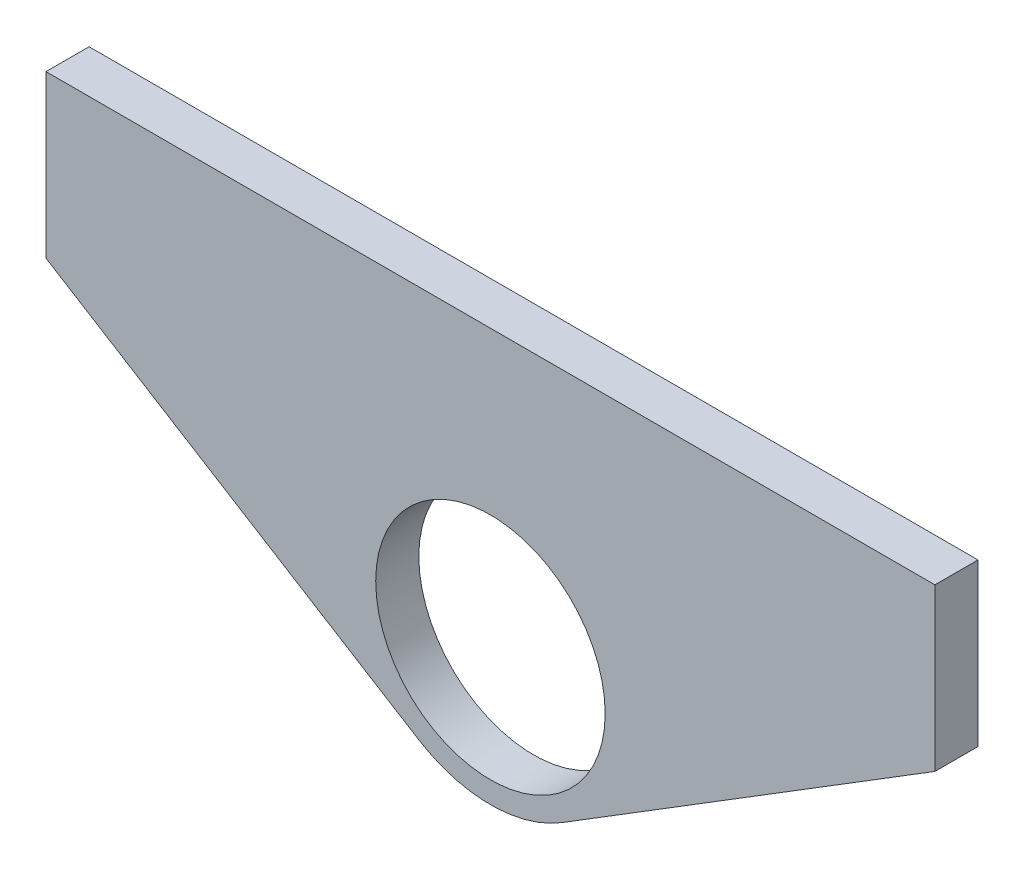
ISO-10303-21;
HEADER;
FILE_DESCRIPTION(('STEP AP214'),'2;1');
FILE_NAME('part.step','',(''),(''),'','','');
FILE_SCHEMA(('AUTOMOTIVE_DESIGN { 1 0 10303 214 1 1 1 1 }'));
ENDSEC;
DATA;
#1=APPLICATION_CONTEXT('core data for automotive mechanical design processes');
#2=APPLICATION_PROTOCOL_DEFINITION('international standard','automotive_design',2000,#1);
#3=PRODUCT_CONTEXT('',#1,'mechanical');
#4=PRODUCT('Part','Part','',(#3));
#5=PRODUCT_RELATED_PRODUCT_CATEGORY('part','',(#4));
#6=PRODUCT_DEFINITION_FORMATION('','',#4);
#7=PRODUCT_DEFINITION_CONTEXT('part definition',#1,'design');
#8=PRODUCT_DEFINITION('design','',#6,#7);
#9=PRODUCT_DEFINITION_SHAPE('','',#8);
#10=(LENGTH_UNIT() NAMED_UNIT(*) SI_UNIT(.MILLI.,.METRE.));
#11=(NAMED_UNIT(*) PLANE_ANGLE_UNIT() SI_UNIT($,.RADIAN.));
#12=(NAMED_UNIT(*) SI_UNIT($,.STERADIAN.) SOLID_ANGLE_UNIT());
#13=UNCERTAINTY_MEASURE_WITH_UNIT(LENGTH_MEASURE(1.E-05),#10,'distance_accuracy_value','');
#14=(GEOMETRIC_REPRESENTATION_CONTEXT(3) GLOBAL_UNCERTAINTY_ASSIGNED_CONTEXT((#13)) GLOBAL_UNIT_ASSIGNED_CONTEXT((#10,
#11,#12)) REPRESENTATION_CONTEXT('',''));
#15=CARTESIAN_POINT('',(0.,0.,0.));
#16=DIRECTION('',(0.,0.,1.));
#17=DIRECTION('',(1.,0.,0.));
#18=AXIS2_PLACEMENT_3D('',#15,#16,#17);
#19=CARTESIAN_POINT('',(0.,15.,-4.));
#20=DIRECTION('',(0.999999999999999,0.,0.));
#21=DIRECTION('',(0.,0.999999999999999,0.));
#22=AXIS2_PLACEMENT_3D('',#19,#20,#21);
#23=PLANE('',#22);
#24=DIRECTION('',(0.,0.999999999999999,0.));
#25=VECTOR('',#24,1.);
#26=CARTESIAN_POINT('',(0.,15.,0.));
#27=LINE('',#26,#25);
#28=CARTESIAN_POINT('',(0.,0.,0.));
#29=VERTEX_POINT('',#28);
#30=CARTESIAN_POINT('',(0.,15.,0.));
#31=VERTEX_POINT('',#30);
#32=EDGE_CURVE('E119',#29,#31,#27,.T.);
#33=ORIENTED_EDGE('',*,*,#32,.F.);
#34=DIRECTION('',(0.,0.,0.999999999999999));
#35=VECTOR('',#34,1.);
#36=CARTESIAN_POINT('',(0.,0.,-4.));
#37=LINE('',#36,#35);
#38=CARTESIAN_POINT('',(0.,0.,-4.));
#39=VERTEX_POINT('',#38);
#40=EDGE_CURVE('E11',#39,#29,#37,.T.);
#41=ORIENTED_EDGE('',*,*,#40,.F.);
#42=DIRECTION('',(0.,0.999999999999999,0.));
#43=VECTOR('',#42,1.);
#44=CARTESIAN_POINT('',(0.,15.,-4.));
#45=LINE('',#44,#43);
#46=CARTESIAN_POINT('',(0.,15.,-4.));
#47=VERTEX_POINT('',#46);
#48=EDGE_CURVE('E134',#39,#47,#45,.T.);
#49=ORIENTED_EDGE('',*,*,#48,.T.);
#50=DIRECTION('',(0.,0.,0.999999999999999));
#51=VECTOR('',#50,1.);
#52=CARTESIAN_POINT('',(0.,15.,-4.));
#53=LINE('',#52,#51);
#54=EDGE_CURVE('E37',#47,#31,#53,.T.);
#55=ORIENTED_EDGE('',*,*,#54,.T.);
#56=EDGE_LOOP('',(#33,#41,#49,#55));
#57=FACE_BOUND('',#56,.T.);
#58=ADVANCED_FACE('F34',(#57),#23,.T.);
#59=CARTESIAN_POINT('',(0.,0.,-4.));
#60=DIRECTION('',(0.5262032264563,-0.850358844527989,0.));
#61=DIRECTION('',(0.85035884452799,0.526203226456302,0.));
#62=AXIS2_PLACEMENT_3D('',#59,#60,#61);
#63=PLANE('',#62);
#64=DIRECTION('',(0.85035884452799,0.526203226456302,0.));
#65=VECTOR('',#64,1.);
#66=CARTESIAN_POINT('',(0.,0.,0.));
#67=LINE('',#66,#65);
#68=CARTESIAN_POINT('',(-34.5943627091045,-21.4070393832791,-1.66533453693773E-13));
#69=VERTEX_POINT('',#68);
#70=EDGE_CURVE('E132',#69,#29,#67,.T.);
#71=ORIENTED_EDGE('',*,*,#70,.F.);
#72=DIRECTION('',(0.,0.,0.999999999999999));
#73=VECTOR('',#72,1.);
#74=CARTESIAN_POINT('',(-34.5943627091045,-21.4070393832791,-4.00000000000017));
#75=LINE('',#74,#73);
#76=CARTESIAN_POINT('',(-34.5943627091045,-21.4070393832791,-4.00000000000017));
#77=VERTEX_POINT('',#76);
#78=EDGE_CURVE('E43',#77,#69,#75,.T.);
#79=ORIENTED_EDGE('',*,*,#78,.F.);
#80=DIRECTION('',(0.85035884452799,0.526203226456302,0.));
#81=VECTOR('',#80,1.);
#82=CARTESIAN_POINT('',(0.,0.,-4.));
#83=LINE('',#82,#81);
#84=EDGE_CURVE('E109',#77,#39,#83,.T.);
#85=ORIENTED_EDGE('',*,*,#84,.T.);
#86=ORIENTED_EDGE('',*,*,#40,.T.);
#87=EDGE_LOOP('',(#71,#79,#85,#86));
#88=FACE_BOUND('',#87,.T.);
#89=ADVANCED_FACE('F142',(#88),#63,.T.);
#90=CARTESIAN_POINT('',(-41.2508335237767,-10.6500000000001,-4.00000000000011));
#91=DIRECTION('',(0.,0.,0.999999999999999));
#92=DIRECTION('',(0.999999999999999,0.,0.));
#93=AXIS2_PLACEMENT_3D('',#90,#91,#92);
#94=CYLINDRICAL_SURFACE('',#93,12.65);
#95=CARTESIAN_POINT('',(-41.2508335237767,-10.6500000000001,-1.66533453693773E-13));
#96=DIRECTION('',(0.,0.,0.999999999999999));
#97=DIRECTION('',(0.999999999999999,0.,0.));
#98=AXIS2_PLACEMENT_3D('',#95,#96,#97);
#99=CIRCLE('',#98,12.65);
#100=CARTESIAN_POINT('',(-47.907304338449,-21.4070393832791,0.));
#101=VERTEX_POINT('',#100);
#102=EDGE_CURVE('E96',#101,#69,#99,.T.);
#103=ORIENTED_EDGE('',*,*,#102,.F.);
#104=DIRECTION('',(0.,0.,0.999999999999999));
#105=VECTOR('',#104,1.);
#106=CARTESIAN_POINT('',(-47.907304338449,-21.4070393832791,-4.));
#107=LINE('',#106,#105);
#108=CARTESIAN_POINT('',(-47.907304338449,-21.4070393832791,-4.));
#109=VERTEX_POINT('',#108);
#110=EDGE_CURVE('E91',#109,#101,#107,.T.);
#111=ORIENTED_EDGE('',*,*,#110,.F.);
#112=CARTESIAN_POINT('',(-41.2508335237767,-10.6500000000001,-4.00000000000011));
#113=DIRECTION('',(0.,0.,0.999999999999999));
#114=DIRECTION('',(0.999999999999999,0.,0.));
#115=AXIS2_PLACEMENT_3D('',#112,#113,#114);
#116=CIRCLE('',#115,12.65);
#117=EDGE_CURVE('E94',#109,#77,#116,.T.);
#118=ORIENTED_EDGE('',*,*,#117,.T.);
#119=ORIENTED_EDGE('',*,*,#78,.T.);
#120=EDGE_LOOP('',(#103,#111,#118,#119));
#121=FACE_BOUND('',#120,.T.);
#122=ADVANCED_FACE('F93',(#121),#94,.T.);
#123=CARTESIAN_POINT('',(-82.5016670475535,0.,-4.));
#124=DIRECTION('',(-0.526203226456302,-0.85035884452799,0.));
#125=DIRECTION('',(0.850358844527989,-0.5262032264563,0.));
#126=AXIS2_PLACEMENT_3D('',#123,#124,#125);
#127=PLANE('',#126);
#128=DIRECTION('',(0.850358844527989,-0.5262032264563,0.));
#129=VECTOR('',#128,1.);
#130=CARTESIAN_POINT('',(-82.5016670475535,0.,0.));
#131=LINE('',#130,#129);
#132=CARTESIAN_POINT('',(-82.5016670475535,0.,0.));
#133=VERTEX_POINT('',#132);
#134=EDGE_CURVE('E129',#133,#101,#131,.T.);
#135=ORIENTED_EDGE('',*,*,#134,.F.);
#136=DIRECTION('',(0.,0.,0.999999999999999));
#137=VECTOR('',#136,1.);
#138=CARTESIAN_POINT('',(-82.5016670475535,0.,-4.));
#139=LINE('',#138,#137);
#140=CARTESIAN_POINT('',(-82.5016670475535,0.,-4.));
#141=VERTEX_POINT('',#140);
#142=EDGE_CURVE('E101',#141,#133,#139,.T.);
#143=ORIENTED_EDGE('',*,*,#142,.F.);
#144=DIRECTION('',(0.850358844527989,-0.5262032264563,0.));
#145=VECTOR('',#144,1.);
#146=CARTESIAN_POINT('',(-82.5016670475535,0.,-4.));
#147=LINE('',#146,#145);
#148=EDGE_CURVE('E107',#141,#109,#147,.T.);
#149=ORIENTED_EDGE('',*,*,#148,.T.);
#150=ORIENTED_EDGE('',*,*,#110,.T.);
#151=EDGE_LOOP('',(#135,#143,#149,#150));
#152=FACE_BOUND('',#151,.T.);
#153=ADVANCED_FACE('F111',(#152),#127,.T.);
#154=CARTESIAN_POINT('',(-82.5016670475535,0.,-4.));
#155=DIRECTION('',(-0.999999999999999,0.,0.));
#156=DIRECTION('',(0.,-0.999999999999999,0.));
#157=AXIS2_PLACEMENT_3D('',#154,#155,#156);
#158=PLANE('',#157);
#159=DIRECTION('',(0.,-0.999999999999999,0.));
#160=VECTOR('',#159,1.);
#161=CARTESIAN_POINT('',(-82.5016670475535,0.,0.));
#162=LINE('',#161,#160);
#163=CARTESIAN_POINT('',(-82.5016670475535,14.9999999999999,0.));
#164=VERTEX_POINT('',#163);
#165=EDGE_CURVE('E126',#164,#133,#162,.T.);
#166=ORIENTED_EDGE('',*,*,#165,.F.);
#167=DIRECTION('',(0.,0.,0.999999999999999));
#168=VECTOR('',#167,1.);
#169=CARTESIAN_POINT('',(-82.5016670475535,14.9999999999999,-4.));
#170=LINE('',#169,#168);
#171=CARTESIAN_POINT('',(-82.5016670475535,14.9999999999999,-4.));
#172=VERTEX_POINT('',#171);
#173=EDGE_CURVE('E137',#172,#164,#170,.T.);
#174=ORIENTED_EDGE('',*,*,#173,.F.);
#175=DIRECTION('',(0.,-0.999999999999999,0.));
#176=VECTOR('',#175,1.);
#177=CARTESIAN_POINT('',(-82.5016670475535,0.,-4.));
#178=LINE('',#177,#176);
#179=EDGE_CURVE('E112',#172,#141,#178,.T.);
#180=ORIENTED_EDGE('',*,*,#179,.T.);
#181=ORIENTED_EDGE('',*,*,#142,.T.);
#182=EDGE_LOOP('',(#166,#174,#180,#181));
#183=FACE_BOUND('',#182,.T.);
#184=ADVANCED_FACE('F155',(#183),#158,.T.);
#185=CARTESIAN_POINT('',(-82.5016670475535,14.9999999999999,-4.));
#186=DIRECTION('',(0.,0.999999999999999,0.));
#187=DIRECTION('',(0.,0.,0.999999999999999));
#188=AXIS2_PLACEMENT_3D('',#185,#186,#187);
#189=PLANE('',#188);
#190=DIRECTION('',(-0.999999999999999,0.,0.));
#191=VECTOR('',#190,1.);
#192=CARTESIAN_POINT('',(-82.5016670475535,14.9999999999999,0.));
#193=LINE('',#192,#191);
#194=EDGE_CURVE('E122',#31,#164,#193,.T.);
#195=ORIENTED_EDGE('',*,*,#194,.F.);
#196=ORIENTED_EDGE('',*,*,#54,.F.);
#197=DIRECTION('',(-0.999999999999999,0.,0.));
#198=VECTOR('',#197,1.);
#199=CARTESIAN_POINT('',(-82.5016670475535,14.9999999999999,-4.));
#200=LINE('',#199,#198);
#201=EDGE_CURVE('E114',#47,#172,#200,.T.);
#202=ORIENTED_EDGE('',*,*,#201,.T.);
#203=ORIENTED_EDGE('',*,*,#173,.T.);
#204=EDGE_LOOP('',(#195,#196,#202,#203));
#205=FACE_BOUND('',#204,.T.);
#206=ADVANCED_FACE('F139',(#205),#189,.T.);
#207=CARTESIAN_POINT('',(-41.2508335237767,-10.6500000000001,-4.00000000000011));
#208=DIRECTION('',(0.,0.,0.999999999999999));
#209=DIRECTION('',(0.999999999999999,0.,0.));
#210=AXIS2_PLACEMENT_3D('',#207,#208,#209);
#211=PLANE('',#210);
#212=CARTESIAN_POINT('',(-41.2508335237768,-10.6500000000001,-4.00000000000011));
#213=DIRECTION('',(0.,0.,0.999999999999999));
#214=DIRECTION('',(0.999999999999999,0.,0.));
#215=AXIS2_PLACEMENT_3D('',#212,#213,#214);
#216=CIRCLE('',#215,10.65);
#217=CARTESIAN_POINT('',(-30.6008335237768,-10.6500000000001,-4.00000000000011));
#218=VERTEX_POINT('',#217);
#219=EDGE_CURVE('E123',#218,#218,#216,.T.);
#220=ORIENTED_EDGE('',*,*,#219,.T.);
#221=EDGE_LOOP('',(#220));
#222=FACE_BOUND('',#221,.T.);
#223=ORIENTED_EDGE('',*,*,#48,.F.);
#224=ORIENTED_EDGE('',*,*,#84,.F.);
#225=ORIENTED_EDGE('',*,*,#117,.F.);
#226=ORIENTED_EDGE('',*,*,#148,.F.);
#227=ORIENTED_EDGE('',*,*,#179,.F.);
#228=ORIENTED_EDGE('',*,*,#201,.F.);
#229=EDGE_LOOP('',(#223,#224,#225,#226,#227,#228));
#230=FACE_BOUND('',#229,.T.);
#231=ADVANCED_FACE('F105',(#222,#230),#211,.F.);
#232=CARTESIAN_POINT('',(-41.2508335237767,-10.6500000000001,-1.66533453693773E-13));
#233=DIRECTION('',(0.,0.,0.999999999999999));
#234=DIRECTION('',(0.999999999999999,0.,0.));
#235=AXIS2_PLACEMENT_3D('',#232,#233,#234);
#236=PLANE('',#235);
#237=CARTESIAN_POINT('',(-41.2508335237768,-10.6500000000001,-1.66533453693773E-13));
#238=DIRECTION('',(0.,0.,0.999999999999999));
#239=DIRECTION('',(0.999999999999999,0.,0.));
#240=AXIS2_PLACEMENT_3D('',#237,#238,#239);
#241=CIRCLE('',#240,10.65);
#242=CARTESIAN_POINT('',(-30.6008335237768,-10.65,-1.66533453693773E-13));
#243=VERTEX_POINT('',#242);
#244=EDGE_CURVE('E178',#243,#243,#241,.T.);
#245=ORIENTED_EDGE('',*,*,#244,.F.);
#246=EDGE_LOOP('',(#245));
#247=FACE_BOUND('',#246,.T.);
#248=ORIENTED_EDGE('',*,*,#32,.T.);
#249=ORIENTED_EDGE('',*,*,#194,.T.);
#250=ORIENTED_EDGE('',*,*,#165,.T.);
#251=ORIENTED_EDGE('',*,*,#134,.T.);
#252=ORIENTED_EDGE('',*,*,#102,.T.);
#253=ORIENTED_EDGE('',*,*,#70,.T.);
#254=EDGE_LOOP('',(#248,#249,#250,#251,#252,#253));
#255=FACE_BOUND('',#254,.T.);
#256=ADVANCED_FACE('F141',(#247,#255),#236,.T.);
#257=CARTESIAN_POINT('',(-41.2508335237768,-10.6500000000001,-4.00000000000011));
#258=DIRECTION('',(0.,0.,0.999999999999999));
#259=DIRECTION('',(0.999999999999999,0.,0.));
#260=AXIS2_PLACEMENT_3D('',#257,#258,#259);
#261=CYLINDRICAL_SURFACE('',#260,10.65);
#262=ORIENTED_EDGE('',*,*,#219,.F.);
#263=EDGE_LOOP('',(#262));
#264=FACE_BOUND('',#263,.T.);
#265=ORIENTED_EDGE('',*,*,#244,.T.);
#266=EDGE_LOOP('',(#265));
#267=FACE_BOUND('',#266,.T.);
#268=ADVANCED_FACE('F166',(#264,#267),#261,.F.);
#269=CLOSED_SHELL('',(#58,#89,#122,#153,#184,#206,#231,#256,#268));
#270=MANIFOLD_SOLID_BREP('B2',#269);
#271=ADVANCED_BREP_SHAPE_REPRESENTATION('',(#18,#270),#14);
#272=SHAPE_DEFINITION_REPRESENTATION(#9,#271);
ENDSEC;
END-ISO-10303-21;
